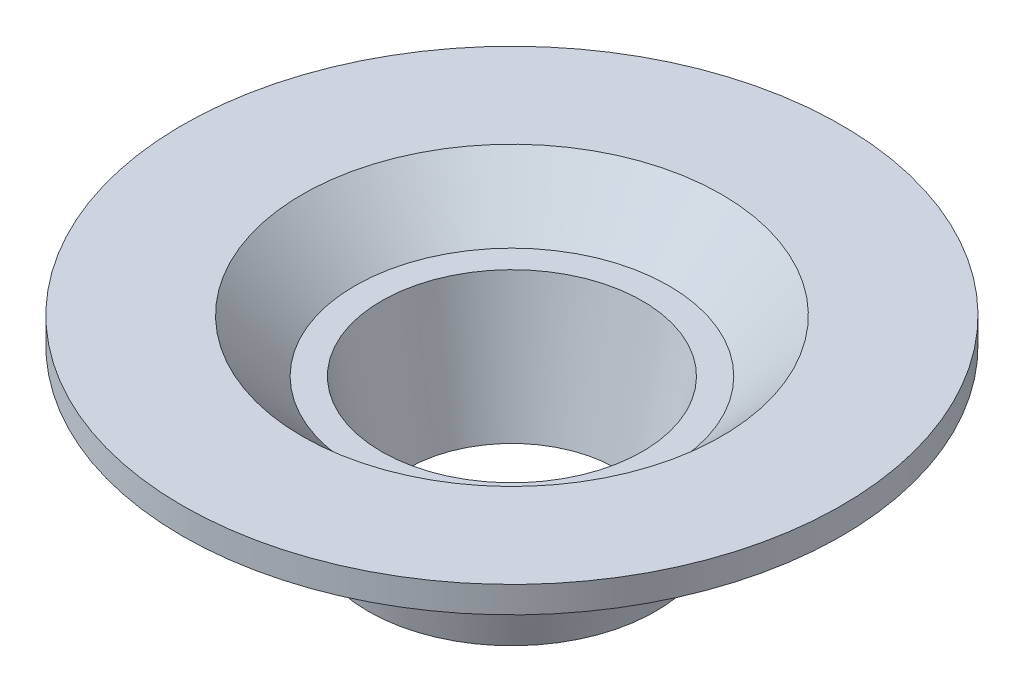
ISO-10303-21;
HEADER;
FILE_DESCRIPTION(('STEP AP214'),'2;1');
FILE_NAME('part.step','',(''),(''),'','','');
FILE_SCHEMA(('AUTOMOTIVE_DESIGN { 1 0 10303 214 1 1 1 1 }'));
ENDSEC;
DATA;
#1=APPLICATION_CONTEXT('core data for automotive mechanical design processes');
#2=APPLICATION_PROTOCOL_DEFINITION('international standard','automotive_design',2000,#1);
#3=PRODUCT_CONTEXT('',#1,'mechanical');
#4=PRODUCT('Part','Part','',(#3));
#5=PRODUCT_RELATED_PRODUCT_CATEGORY('part','',(#4));
#6=PRODUCT_DEFINITION_FORMATION('','',#4);
#7=PRODUCT_DEFINITION_CONTEXT('part definition',#1,'design');
#8=PRODUCT_DEFINITION('design','',#6,#7);
#9=PRODUCT_DEFINITION_SHAPE('','',#8);
#10=(LENGTH_UNIT() NAMED_UNIT(*) SI_UNIT(.MILLI.,.METRE.));
#11=(NAMED_UNIT(*) PLANE_ANGLE_UNIT() SI_UNIT($,.RADIAN.));
#12=(NAMED_UNIT(*) SI_UNIT($,.STERADIAN.) SOLID_ANGLE_UNIT());
#13=UNCERTAINTY_MEASURE_WITH_UNIT(LENGTH_MEASURE(1.E-05),#10,'distance_accuracy_value','');
#14=(GEOMETRIC_REPRESENTATION_CONTEXT(3) GLOBAL_UNCERTAINTY_ASSIGNED_CONTEXT((#13)) GLOBAL_UNIT_ASSIGNED_CONTEXT((#10,
#11,#12)) REPRESENTATION_CONTEXT('',''));
#15=CARTESIAN_POINT('',(0.,0.,0.));
#16=DIRECTION('',(0.,0.,1.));
#17=DIRECTION('',(1.,0.,0.));
#18=AXIS2_PLACEMENT_3D('',#15,#16,#17);
#19=CARTESIAN_POINT('',(0.,0.,0.));
#20=DIRECTION('',(0.,1.,0.));
#21=DIRECTION('',(0.,0.,1.));
#22=AXIS2_PLACEMENT_3D('',#19,#20,#21);
#23=CONICAL_SURFACE('',#22,4.95,0.197395559849881);
#24=CARTESIAN_POINT('',(0.,-5.,0.));
#25=DIRECTION('',(0.,1.,0.));
#26=DIRECTION('',(0.,0.,1.));
#27=AXIS2_PLACEMENT_3D('',#24,#25,#26);
#28=CIRCLE('',#27,3.95);
#29=CARTESIAN_POINT('',(0.,-5.,3.95));
#30=VERTEX_POINT('',#29);
#31=EDGE_CURVE('E69',#30,#30,#28,.T.);
#32=ORIENTED_EDGE('',*,*,#31,.F.);
#33=EDGE_LOOP('',(#32));
#34=FACE_BOUND('',#33,.T.);
#35=CARTESIAN_POINT('',(0.,0.,0.));
#36=DIRECTION('',(0.,1.,0.));
#37=DIRECTION('',(0.,0.,1.));
#38=AXIS2_PLACEMENT_3D('',#35,#36,#37);
#39=CIRCLE('',#38,4.95);
#40=CARTESIAN_POINT('',(0.,0.,4.95));
#41=VERTEX_POINT('',#40);
#42=EDGE_CURVE('E10',#41,#41,#39,.T.);
#43=ORIENTED_EDGE('',*,*,#42,.T.);
#44=EDGE_LOOP('',(#43));
#45=FACE_BOUND('',#44,.T.);
#46=ADVANCED_FACE('F35',(#34,#45),#23,.F.);
#47=CARTESIAN_POINT('',(4.95,0.,0.));
#48=DIRECTION('',(0.,-1.,0.));
#49=DIRECTION('',(0.,0.,-1.));
#50=AXIS2_PLACEMENT_3D('',#47,#48,#49);
#51=PLANE('',#50);
#52=ORIENTED_EDGE('',*,*,#42,.F.);
#53=EDGE_LOOP('',(#52));
#54=FACE_BOUND('',#53,.T.);
#55=CARTESIAN_POINT('',(0.,0.,0.));
#56=DIRECTION('',(0.,1.,0.));
#57=DIRECTION('',(0.,0.,1.));
#58=AXIS2_PLACEMENT_3D('',#55,#56,#57);
#59=CIRCLE('',#58,5.95);
#60=CARTESIAN_POINT('',(0.,0.,5.95));
#61=VERTEX_POINT('',#60);
#62=EDGE_CURVE('E41',#61,#61,#59,.T.);
#63=ORIENTED_EDGE('',*,*,#62,.T.);
#64=EDGE_LOOP('',(#63));
#65=FACE_BOUND('',#64,.T.);
#66=ADVANCED_FACE('F76',(#54,#65),#51,.F.);
#67=CARTESIAN_POINT('',(0.,2.,0.));
#68=DIRECTION('',(0.,1.,0.));
#69=DIRECTION('',(0.,0.,1.));
#70=AXIS2_PLACEMENT_3D('',#67,#68,#69);
#71=CONICAL_SURFACE('',#70,7.95,0.785398163397448);
#72=ORIENTED_EDGE('',*,*,#62,.F.);
#73=EDGE_LOOP('',(#72));
#74=FACE_BOUND('',#73,.T.);
#75=CARTESIAN_POINT('',(0.,2.,0.));
#76=DIRECTION('',(0.,1.,0.));
#77=DIRECTION('',(0.,0.,1.));
#78=AXIS2_PLACEMENT_3D('',#75,#76,#77);
#79=CIRCLE('',#78,7.95);
#80=CARTESIAN_POINT('',(0.,2.,7.95));
#81=VERTEX_POINT('',#80);
#82=EDGE_CURVE('E45',#81,#81,#79,.T.);
#83=ORIENTED_EDGE('',*,*,#82,.T.);
#84=EDGE_LOOP('',(#83));
#85=FACE_BOUND('',#84,.T.);
#86=ADVANCED_FACE('F80',(#74,#85),#71,.F.);
#87=CARTESIAN_POINT('',(7.95,2.,0.));
#88=DIRECTION('',(0.,-1.,0.));
#89=DIRECTION('',(0.,0.,-1.));
#90=AXIS2_PLACEMENT_3D('',#87,#88,#89);
#91=PLANE('',#90);
#92=ORIENTED_EDGE('',*,*,#82,.F.);
#93=EDGE_LOOP('',(#92));
#94=FACE_BOUND('',#93,.T.);
#95=CARTESIAN_POINT('',(0.,2.,0.));
#96=DIRECTION('',(0.,1.,0.));
#97=DIRECTION('',(0.,0.,1.));
#98=AXIS2_PLACEMENT_3D('',#95,#96,#97);
#99=CIRCLE('',#98,12.5);
#100=CARTESIAN_POINT('',(0.,2.,12.5));
#101=VERTEX_POINT('',#100);
#102=EDGE_CURVE('E49',#101,#101,#99,.T.);
#103=ORIENTED_EDGE('',*,*,#102,.T.);
#104=EDGE_LOOP('',(#103));
#105=FACE_BOUND('',#104,.T.);
#106=ADVANCED_FACE('F85',(#94,#105),#91,.F.);
#107=CARTESIAN_POINT('',(0.,0.,0.));
#108=DIRECTION('',(0.,1.,0.));
#109=DIRECTION('',(0.,0.,1.));
#110=AXIS2_PLACEMENT_3D('',#107,#108,#109);
#111=CYLINDRICAL_SURFACE('',#110,12.5);
#112=ORIENTED_EDGE('',*,*,#102,.F.);
#113=EDGE_LOOP('',(#112));
#114=FACE_BOUND('',#113,.T.);
#115=CARTESIAN_POINT('',(0.,1.,0.));
#116=DIRECTION('',(0.,1.,0.));
#117=DIRECTION('',(0.,0.,1.));
#118=AXIS2_PLACEMENT_3D('',#115,#116,#117);
#119=CIRCLE('',#118,12.5);
#120=CARTESIAN_POINT('',(0.,1.,12.5));
#121=VERTEX_POINT('',#120);
#122=EDGE_CURVE('E54',#121,#121,#119,.T.);
#123=ORIENTED_EDGE('',*,*,#122,.T.);
#124=EDGE_LOOP('',(#123));
#125=FACE_BOUND('',#124,.T.);
#126=ADVANCED_FACE('F91',(#114,#125),#111,.T.);
#127=CARTESIAN_POINT('',(12.5,1.,0.));
#128=DIRECTION('',(0.,1.,0.));
#129=DIRECTION('',(0.,0.,1.));
#130=AXIS2_PLACEMENT_3D('',#127,#128,#129);
#131=PLANE('',#130);
#132=ORIENTED_EDGE('',*,*,#122,.F.);
#133=EDGE_LOOP('',(#132));
#134=FACE_BOUND('',#133,.T.);
#135=CARTESIAN_POINT('',(0.,1.,0.));
#136=DIRECTION('',(0.,1.,0.));
#137=DIRECTION('',(0.,0.,1.));
#138=AXIS2_PLACEMENT_3D('',#135,#136,#137);
#139=CIRCLE('',#138,10.5);
#140=CARTESIAN_POINT('',(0.,1.,10.5));
#141=VERTEX_POINT('',#140);
#142=EDGE_CURVE('E57',#141,#141,#139,.T.);
#143=ORIENTED_EDGE('',*,*,#142,.T.);
#144=EDGE_LOOP('',(#143));
#145=FACE_BOUND('',#144,.T.);
#146=ADVANCED_FACE('F95',(#134,#145),#131,.F.);
#147=CARTESIAN_POINT('',(0.,-0.999999999999998,0.));
#148=DIRECTION('',(0.,1.,0.));
#149=DIRECTION('',(0.,0.,1.));
#150=AXIS2_PLACEMENT_3D('',#147,#148,#149);
#151=CONICAL_SURFACE('',#150,8.5,0.785398163397448);
#152=ORIENTED_EDGE('',*,*,#142,.F.);
#153=EDGE_LOOP('',(#152));
#154=FACE_BOUND('',#153,.T.);
#155=CARTESIAN_POINT('',(0.,-0.999999999999998,0.));
#156=DIRECTION('',(0.,1.,0.));
#157=DIRECTION('',(0.,0.,1.));
#158=AXIS2_PLACEMENT_3D('',#155,#156,#157);
#159=CIRCLE('',#158,8.5);
#160=CARTESIAN_POINT('',(0.,-0.999999999999998,8.5));
#161=VERTEX_POINT('',#160);
#162=EDGE_CURVE('E60',#161,#161,#159,.T.);
#163=ORIENTED_EDGE('',*,*,#162,.T.);
#164=EDGE_LOOP('',(#163));
#165=FACE_BOUND('',#164,.T.);
#166=ADVANCED_FACE('F99',(#154,#165),#151,.T.);
#167=CARTESIAN_POINT('',(8.5,-0.999999999999998,0.));
#168=DIRECTION('',(0.,1.,0.));
#169=DIRECTION('',(0.,0.,1.));
#170=AXIS2_PLACEMENT_3D('',#167,#168,#169);
#171=PLANE('',#170);
#172=ORIENTED_EDGE('',*,*,#162,.F.);
#173=EDGE_LOOP('',(#172));
#174=FACE_BOUND('',#173,.T.);
#175=CARTESIAN_POINT('',(0.,-0.999999999999998,0.));
#176=DIRECTION('',(0.,1.,0.));
#177=DIRECTION('',(0.,0.,1.));
#178=AXIS2_PLACEMENT_3D('',#175,#176,#177);
#179=CIRCLE('',#178,6.25);
#180=CARTESIAN_POINT('',(0.,-0.999999999999998,6.25));
#181=VERTEX_POINT('',#180);
#182=EDGE_CURVE('E63',#181,#181,#179,.T.);
#183=ORIENTED_EDGE('',*,*,#182,.T.);
#184=EDGE_LOOP('',(#183));
#185=FACE_BOUND('',#184,.T.);
#186=ADVANCED_FACE('F103',(#174,#185),#171,.F.);
#187=CARTESIAN_POINT('',(0.,-5.,0.));
#188=DIRECTION('',(0.,1.,0.));
#189=DIRECTION('',(0.,0.,1.));
#190=AXIS2_PLACEMENT_3D('',#187,#188,#189);
#191=CONICAL_SURFACE('',#190,5.45,0.19739555984988);
#192=ORIENTED_EDGE('',*,*,#182,.F.);
#193=EDGE_LOOP('',(#192));
#194=FACE_BOUND('',#193,.T.);
#195=CARTESIAN_POINT('',(0.,-5.,0.));
#196=DIRECTION('',(0.,1.,0.));
#197=DIRECTION('',(0.,0.,1.));
#198=AXIS2_PLACEMENT_3D('',#195,#196,#197);
#199=CIRCLE('',#198,5.45);
#200=CARTESIAN_POINT('',(0.,-5.,5.45));
#201=VERTEX_POINT('',#200);
#202=EDGE_CURVE('E66',#201,#201,#199,.T.);
#203=ORIENTED_EDGE('',*,*,#202,.T.);
#204=EDGE_LOOP('',(#203));
#205=FACE_BOUND('',#204,.T.);
#206=ADVANCED_FACE('F107',(#194,#205),#191,.T.);
#207=CARTESIAN_POINT('',(5.45,-5.,0.));
#208=DIRECTION('',(0.,1.,0.));
#209=DIRECTION('',(0.,0.,1.));
#210=AXIS2_PLACEMENT_3D('',#207,#208,#209);
#211=PLANE('',#210);
#212=ORIENTED_EDGE('',*,*,#202,.F.);
#213=EDGE_LOOP('',(#212));
#214=FACE_BOUND('',#213,.T.);
#215=ORIENTED_EDGE('',*,*,#31,.T.);
#216=EDGE_LOOP('',(#215));
#217=FACE_BOUND('',#216,.T.);
#218=ADVANCED_FACE('F73',(#214,#217),#211,.F.);
#219=CLOSED_SHELL('',(#46,#66,#86,#106,#126,#146,#166,#186,#206,#218));
#220=MANIFOLD_SOLID_BREP('B2',#219);
#221=ADVANCED_BREP_SHAPE_REPRESENTATION('',(#18,#220),#14);
#222=SHAPE_DEFINITION_REPRESENTATION(#9,#221);
ENDSEC;
END-ISO-10303-21;
